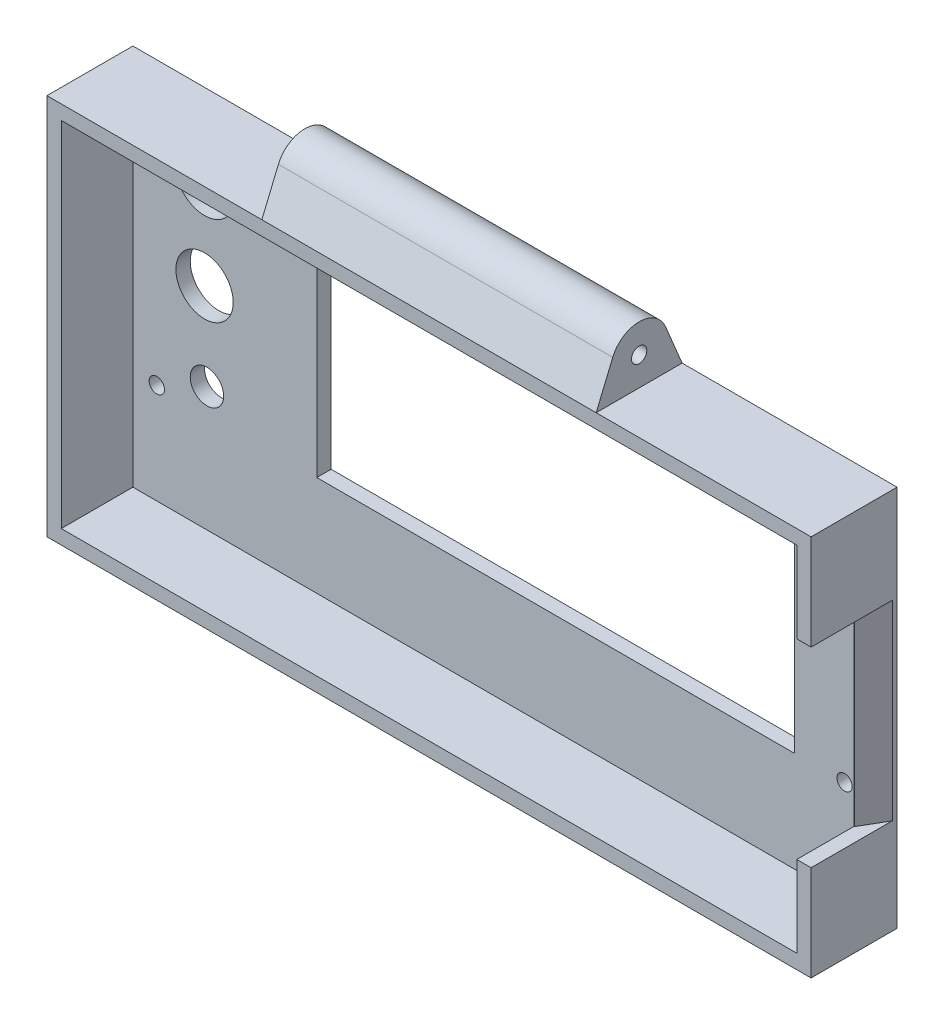
ISO-10303-21;
HEADER;
FILE_DESCRIPTION(('STEP AP214'),'2;1');
FILE_NAME('part.step','',(''),(''),'','','');
FILE_SCHEMA(('AUTOMOTIVE_DESIGN { 1 0 10303 214 1 1 1 1 }'));
ENDSEC;
DATA;
#1=APPLICATION_CONTEXT('core data for automotive mechanical design processes');
#2=APPLICATION_PROTOCOL_DEFINITION('international standard','automotive_design',2000,#1);
#3=PRODUCT_CONTEXT('',#1,'mechanical');
#4=PRODUCT('Part','Part','',(#3));
#5=PRODUCT_RELATED_PRODUCT_CATEGORY('part','',(#4));
#6=PRODUCT_DEFINITION_FORMATION('','',#4);
#7=PRODUCT_DEFINITION_CONTEXT('part definition',#1,'design');
#8=PRODUCT_DEFINITION('design','',#6,#7);
#9=PRODUCT_DEFINITION_SHAPE('','',#8);
#10=(LENGTH_UNIT() NAMED_UNIT(*) SI_UNIT(.MILLI.,.METRE.));
#11=(NAMED_UNIT(*) PLANE_ANGLE_UNIT() SI_UNIT($,.RADIAN.));
#12=(NAMED_UNIT(*) SI_UNIT($,.STERADIAN.) SOLID_ANGLE_UNIT());
#13=UNCERTAINTY_MEASURE_WITH_UNIT(LENGTH_MEASURE(1.E-05),#10,'distance_accuracy_value','');
#14=(GEOMETRIC_REPRESENTATION_CONTEXT(3) GLOBAL_UNCERTAINTY_ASSIGNED_CONTEXT((#13)) GLOBAL_UNIT_ASSIGNED_CONTEXT((#10,
#11,#12)) REPRESENTATION_CONTEXT('',''));
#15=CARTESIAN_POINT('',(0.,0.,0.));
#16=DIRECTION('',(0.,0.,1.));
#17=DIRECTION('',(1.,0.,0.));
#18=AXIS2_PLACEMENT_3D('',#15,#16,#17);
#19=CARTESIAN_POINT('',(80.,80.,0.));
#20=DIRECTION('',(0.,0.,-1.));
#21=DIRECTION('',(0.,1.,0.));
#22=AXIS2_PLACEMENT_3D('',#19,#20,#21);
#23=PLANE('',#22);
#24=DIRECTION('',(0.,-1.,0.));
#25=VECTOR('',#24,1.);
#26=CARTESIAN_POINT('',(77.,80.,0.));
#27=LINE('',#26,#25);
#28=CARTESIAN_POINT('',(77.,77.,0.));
#29=VERTEX_POINT('',#28);
#30=CARTESIAN_POINT('',(77.,60.,0.));
#31=VERTEX_POINT('',#30);
#32=EDGE_CURVE('E376',#29,#31,#27,.T.);
#33=ORIENTED_EDGE('',*,*,#32,.T.);
#34=DIRECTION('',(1.,0.,0.));
#35=VECTOR('',#34,1.);
#36=CARTESIAN_POINT('',(70.,60.,0.));
#37=LINE('',#36,#35);
#38=CARTESIAN_POINT('',(80.,60.,0.));
#39=VERTEX_POINT('',#38);
#40=EDGE_CURVE('E257',#31,#39,#37,.T.);
#41=ORIENTED_EDGE('',*,*,#40,.T.);
#42=DIRECTION('',(0.,-1.,0.));
#43=VECTOR('',#42,1.);
#44=CARTESIAN_POINT('',(80.,80.,0.));
#45=LINE('',#44,#43);
#46=CARTESIAN_POINT('',(80.,80.,0.));
#47=VERTEX_POINT('',#46);
#48=EDGE_CURVE('E193',#47,#39,#45,.T.);
#49=ORIENTED_EDGE('',*,*,#48,.F.);
#50=DIRECTION('',(-1.,0.,0.));
#51=VECTOR('',#50,1.);
#52=CARTESIAN_POINT('',(80.,80.,0.));
#53=LINE('',#52,#51);
#54=CARTESIAN_POINT('',(35.,80.,0.));
#55=VERTEX_POINT('',#54);
#56=EDGE_CURVE('E213',#47,#55,#53,.T.);
#57=ORIENTED_EDGE('',*,*,#56,.T.);
#58=CARTESIAN_POINT('',(-35.,80.,0.));
#59=VERTEX_POINT('',#58);
#60=EDGE_CURVE('E208',#55,#59,#53,.T.);
#61=ORIENTED_EDGE('',*,*,#60,.T.);
#62=DIRECTION('',(-1.,0.,0.));
#63=VECTOR('',#62,1.);
#64=CARTESIAN_POINT('',(-35.,80.,0.));
#65=LINE('',#64,#63);
#66=CARTESIAN_POINT('',(-80.,80.,0.));
#67=VERTEX_POINT('',#66);
#68=EDGE_CURVE('E261',#59,#67,#65,.T.);
#69=ORIENTED_EDGE('',*,*,#68,.T.);
#70=DIRECTION('',(0.,-1.,0.));
#71=VECTOR('',#70,1.);
#72=CARTESIAN_POINT('',(-80.,80.,0.));
#73=LINE('',#72,#71);
#74=CARTESIAN_POINT('',(-80.,0.,0.));
#75=VERTEX_POINT('',#74);
#76=EDGE_CURVE('E209',#67,#75,#73,.T.);
#77=ORIENTED_EDGE('',*,*,#76,.T.);
#78=DIRECTION('',(-1.,0.,0.));
#79=VECTOR('',#78,1.);
#80=CARTESIAN_POINT('',(80.,0.,0.));
#81=LINE('',#80,#79);
#82=CARTESIAN_POINT('',(80.,0.,0.));
#83=VERTEX_POINT('',#82);
#84=EDGE_CURVE('E192',#83,#75,#81,.T.);
#85=ORIENTED_EDGE('',*,*,#84,.F.);
#86=CARTESIAN_POINT('',(80.,20.,0.));
#87=VERTEX_POINT('',#86);
#88=EDGE_CURVE('E182',#87,#83,#45,.T.);
#89=ORIENTED_EDGE('',*,*,#88,.F.);
#90=DIRECTION('',(1.,0.,0.));
#91=VECTOR('',#90,1.);
#92=CARTESIAN_POINT('',(70.,20.,0.));
#93=LINE('',#92,#91);
#94=CARTESIAN_POINT('',(77.,20.,0.));
#95=VERTEX_POINT('',#94);
#96=EDGE_CURVE('E172',#95,#87,#93,.T.);
#97=ORIENTED_EDGE('',*,*,#96,.F.);
#98=CARTESIAN_POINT('',(77.,3.,0.));
#99=VERTEX_POINT('',#98);
#100=EDGE_CURVE('E385',#95,#99,#27,.T.);
#101=ORIENTED_EDGE('',*,*,#100,.T.);
#102=DIRECTION('',(-1.,0.,0.));
#103=VECTOR('',#102,1.);
#104=CARTESIAN_POINT('',(80.,3.,0.));
#105=LINE('',#104,#103);
#106=CARTESIAN_POINT('',(-77.,3.,0.));
#107=VERTEX_POINT('',#106);
#108=EDGE_CURVE('E211',#99,#107,#105,.T.);
#109=ORIENTED_EDGE('',*,*,#108,.T.);
#110=DIRECTION('',(0.,-1.,0.));
#111=VECTOR('',#110,1.);
#112=CARTESIAN_POINT('',(-77.,80.,0.));
#113=LINE('',#112,#111);
#114=CARTESIAN_POINT('',(-77.,77.,0.));
#115=VERTEX_POINT('',#114);
#116=EDGE_CURVE('E202',#115,#107,#113,.T.);
#117=ORIENTED_EDGE('',*,*,#116,.F.);
#118=DIRECTION('',(-1.,0.,0.));
#119=VECTOR('',#118,1.);
#120=CARTESIAN_POINT('',(80.,77.,0.));
#121=LINE('',#120,#119);
#122=EDGE_CURVE('E381',#29,#115,#121,.T.);
#123=ORIENTED_EDGE('',*,*,#122,.F.);
#124=EDGE_LOOP('',(#33,#41,#49,#57,#61,#69,#77,#85,#89,#97,#101,#109,#117,#123));
#125=FACE_BOUND('',#124,.T.);
#126=ADVANCED_FACE('F32',(#125),#23,.F.);
#127=CARTESIAN_POINT('',(80.,0.,0.));
#128=DIRECTION('',(0.,1.,0.));
#129=DIRECTION('',(0.,0.,1.));
#130=AXIS2_PLACEMENT_3D('',#127,#128,#129);
#131=PLANE('',#130);
#132=DIRECTION('',(0.,0.,-1.));
#133=VECTOR('',#132,1.);
#134=CARTESIAN_POINT('',(-80.,0.,0.));
#135=LINE('',#134,#133);
#136=CARTESIAN_POINT('',(-80.,0.,-18.));
#137=VERTEX_POINT('',#136);
#138=EDGE_CURVE('E198',#75,#137,#135,.T.);
#139=ORIENTED_EDGE('',*,*,#138,.T.);
#140=DIRECTION('',(-1.,0.,0.));
#141=VECTOR('',#140,1.);
#142=CARTESIAN_POINT('',(80.,0.,-18.));
#143=LINE('',#142,#141);
#144=CARTESIAN_POINT('',(80.,0.,-18.));
#145=VERTEX_POINT('',#144);
#146=EDGE_CURVE('E220',#145,#137,#143,.T.);
#147=ORIENTED_EDGE('',*,*,#146,.F.);
#148=DIRECTION('',(0.,0.,-1.));
#149=VECTOR('',#148,1.);
#150=CARTESIAN_POINT('',(80.,0.,0.));
#151=LINE('',#150,#149);
#152=EDGE_CURVE('E196',#83,#145,#151,.T.);
#153=ORIENTED_EDGE('',*,*,#152,.F.);
#154=ORIENTED_EDGE('',*,*,#84,.T.);
#155=EDGE_LOOP('',(#139,#147,#153,#154));
#156=FACE_BOUND('',#155,.T.);
#157=ADVANCED_FACE('F442',(#156),#131,.F.);
#158=CARTESIAN_POINT('',(80.,0.,-18.));
#159=DIRECTION('',(0.,0.,1.));
#160=DIRECTION('',(0.,-1.,0.));
#161=AXIS2_PLACEMENT_3D('',#158,#159,#160);
#162=PLANE('',#161);
#163=CARTESIAN_POINT('',(-72.,24.,-18.));
#164=DIRECTION('',(0.,0.,-1.));
#165=DIRECTION('',(-1.,0.,0.));
#166=AXIS2_PLACEMENT_3D('',#163,#164,#165);
#167=CIRCLE('',#166,1.6);
#168=CARTESIAN_POINT('',(-73.6,24.,-18.));
#169=VERTEX_POINT('',#168);
#170=EDGE_CURVE('E305',#169,#169,#167,.T.);
#171=ORIENTED_EDGE('',*,*,#170,.F.);
#172=EDGE_LOOP('',(#171));
#173=FACE_BOUND('',#172,.T.);
#174=CARTESIAN_POINT('',(-62.,47.,-18.));
#175=DIRECTION('',(0.,0.,-1.));
#176=DIRECTION('',(-1.,0.,0.));
#177=AXIS2_PLACEMENT_3D('',#174,#175,#176);
#178=CIRCLE('',#177,6.);
#179=CARTESIAN_POINT('',(-68.,47.,-18.));
#180=VERTEX_POINT('',#179);
#181=EDGE_CURVE('E300',#180,#180,#178,.T.);
#182=ORIENTED_EDGE('',*,*,#181,.F.);
#183=EDGE_LOOP('',(#182));
#184=FACE_BOUND('',#183,.T.);
#185=CARTESIAN_POINT('',(-61.5,29.,-18.));
#186=DIRECTION('',(0.,0.,-1.));
#187=DIRECTION('',(-1.,0.,0.));
#188=AXIS2_PLACEMENT_3D('',#185,#186,#187);
#189=CIRCLE('',#188,3.5);
#190=CARTESIAN_POINT('',(-65.,29.,-18.));
#191=VERTEX_POINT('',#190);
#192=EDGE_CURVE('E293',#191,#191,#189,.T.);
#193=ORIENTED_EDGE('',*,*,#192,.F.);
#194=EDGE_LOOP('',(#193));
#195=FACE_BOUND('',#194,.T.);
#196=CARTESIAN_POINT('',(-62.,66.,-18.));
#197=DIRECTION('',(0.,0.,-1.));
#198=DIRECTION('',(-1.,0.,0.));
#199=AXIS2_PLACEMENT_3D('',#196,#197,#198);
#200=CIRCLE('',#199,6.25000000000001);
#201=CARTESIAN_POINT('',(-68.25,66.,-18.));
#202=VERTEX_POINT('',#201);
#203=EDGE_CURVE('E291',#202,#202,#200,.T.);
#204=ORIENTED_EDGE('',*,*,#203,.F.);
#205=EDGE_LOOP('',(#204));
#206=FACE_BOUND('',#205,.T.);
#207=CARTESIAN_POINT('',(72.,24.,-18.));
#208=DIRECTION('',(0.,0.,-1.));
#209=DIRECTION('',(-1.,0.,0.));
#210=AXIS2_PLACEMENT_3D('',#207,#208,#209);
#211=CIRCLE('',#210,1.6);
#212=CARTESIAN_POINT('',(70.4,24.,-18.));
#213=VERTEX_POINT('',#212);
#214=EDGE_CURVE('E312',#213,#213,#211,.T.);
#215=ORIENTED_EDGE('',*,*,#214,.F.);
#216=EDGE_LOOP('',(#215));
#217=FACE_BOUND('',#216,.T.);
#218=CARTESIAN_POINT('',(72.,73.,-18.));
#219=DIRECTION('',(0.,0.,-1.));
#220=DIRECTION('',(-1.,0.,0.));
#221=AXIS2_PLACEMENT_3D('',#218,#219,#220);
#222=CIRCLE('',#221,1.60000000000001);
#223=CARTESIAN_POINT('',(70.4,73.,-18.));
#224=VERTEX_POINT('',#223);
#225=EDGE_CURVE('E325',#224,#224,#222,.T.);
#226=ORIENTED_EDGE('',*,*,#225,.F.);
#227=EDGE_LOOP('',(#226));
#228=FACE_BOUND('',#227,.T.);
#229=CARTESIAN_POINT('',(-72.,73.,-18.));
#230=DIRECTION('',(0.,0.,-1.));
#231=DIRECTION('',(-1.,0.,0.));
#232=AXIS2_PLACEMENT_3D('',#229,#230,#231);
#233=CIRCLE('',#232,1.60000000000001);
#234=CARTESIAN_POINT('',(-73.6,73.,-18.));
#235=VERTEX_POINT('',#234);
#236=EDGE_CURVE('E317',#235,#235,#233,.T.);
#237=ORIENTED_EDGE('',*,*,#236,.F.);
#238=EDGE_LOOP('',(#237));
#239=FACE_BOUND('',#238,.T.);
#240=DIRECTION('',(0.,-1.,0.));
#241=VECTOR('',#240,1.);
#242=CARTESIAN_POINT('',(61.5,64.,-18.));
#243=LINE('',#242,#241);
#244=CARTESIAN_POINT('',(61.5,64.,-18.));
#245=VERTEX_POINT('',#244);
#246=CARTESIAN_POINT('',(61.5,24.,-18.));
#247=VERTEX_POINT('',#246);
#248=EDGE_CURVE('E338',#245,#247,#243,.T.);
#249=ORIENTED_EDGE('',*,*,#248,.F.);
#250=DIRECTION('',(1.,0.,0.));
#251=VECTOR('',#250,1.);
#252=CARTESIAN_POINT('',(61.5,64.,-18.));
#253=LINE('',#252,#251);
#254=CARTESIAN_POINT('',(-38.5,64.,-18.));
#255=VERTEX_POINT('',#254);
#256=EDGE_CURVE('E341',#255,#245,#253,.T.);
#257=ORIENTED_EDGE('',*,*,#256,.F.);
#258=DIRECTION('',(0.,1.,0.));
#259=VECTOR('',#258,1.);
#260=CARTESIAN_POINT('',(-38.5,64.,-18.));
#261=LINE('',#260,#259);
#262=CARTESIAN_POINT('',(-38.5,24.,-18.));
#263=VERTEX_POINT('',#262);
#264=EDGE_CURVE('E324',#263,#255,#261,.T.);
#265=ORIENTED_EDGE('',*,*,#264,.F.);
#266=DIRECTION('',(-1.,0.,0.));
#267=VECTOR('',#266,1.);
#268=CARTESIAN_POINT('',(61.5,24.,-18.));
#269=LINE('',#268,#267);
#270=EDGE_CURVE('E335',#247,#263,#269,.T.);
#271=ORIENTED_EDGE('',*,*,#270,.F.);
#272=EDGE_LOOP('',(#249,#257,#265,#271));
#273=FACE_BOUND('',#272,.T.);
#274=DIRECTION('',(0.,1.,0.));
#275=VECTOR('',#274,1.);
#276=CARTESIAN_POINT('',(-80.,0.,-18.));
#277=LINE('',#276,#275);
#278=CARTESIAN_POINT('',(-80.,80.,-18.));
#279=VERTEX_POINT('',#278);
#280=EDGE_CURVE('E194',#137,#279,#277,.T.);
#281=ORIENTED_EDGE('',*,*,#280,.T.);
#282=DIRECTION('',(-1.,0.,0.));
#283=VECTOR('',#282,1.);
#284=CARTESIAN_POINT('',(-35.,80.,-18.));
#285=LINE('',#284,#283);
#286=CARTESIAN_POINT('',(-35.,80.,-18.));
#287=VERTEX_POINT('',#286);
#288=EDGE_CURVE('E265',#287,#279,#285,.T.);
#289=ORIENTED_EDGE('',*,*,#288,.F.);
#290=DIRECTION('',(-1.,0.,0.));
#291=VECTOR('',#290,1.);
#292=CARTESIAN_POINT('',(80.,80.,-18.));
#293=LINE('',#292,#291);
#294=CARTESIAN_POINT('',(35.,80.,-18.));
#295=VERTEX_POINT('',#294);
#296=EDGE_CURVE('E216',#295,#287,#293,.T.);
#297=ORIENTED_EDGE('',*,*,#296,.F.);
#298=CARTESIAN_POINT('',(80.,80.,-18.));
#299=VERTEX_POINT('',#298);
#300=EDGE_CURVE('E217',#299,#295,#293,.T.);
#301=ORIENTED_EDGE('',*,*,#300,.F.);
#302=DIRECTION('',(0.,1.,0.));
#303=VECTOR('',#302,1.);
#304=CARTESIAN_POINT('',(80.,0.,-18.));
#305=LINE('',#304,#303);
#306=EDGE_CURVE('E205',#145,#299,#305,.T.);
#307=ORIENTED_EDGE('',*,*,#306,.F.);
#308=ORIENTED_EDGE('',*,*,#146,.T.);
#309=EDGE_LOOP('',(#281,#289,#297,#301,#307,#308));
#310=FACE_BOUND('',#309,.T.);
#311=ADVANCED_FACE('F437',(#173,#184,#195,#206,#217,#228,#239,#273,#310),#162,.F.);
#312=CARTESIAN_POINT('',(80.,0.,0.));
#313=DIRECTION('',(1.,0.,0.));
#314=DIRECTION('',(0.,0.,-1.));
#315=AXIS2_PLACEMENT_3D('',#312,#313,#314);
#316=PLANE('',#315);
#317=DIRECTION('',(0.,0.,1.));
#318=VECTOR('',#317,1.);
#319=CARTESIAN_POINT('',(80.,60.,0.));
#320=LINE('',#319,#318);
#321=CARTESIAN_POINT('',(80.,60.,-17.));
#322=VERTEX_POINT('',#321);
#323=EDGE_CURVE('E47',#322,#39,#320,.T.);
#324=ORIENTED_EDGE('',*,*,#323,.F.);
#325=DIRECTION('',(0.,-1.,0.));
#326=VECTOR('',#325,1.);
#327=CARTESIAN_POINT('',(80.,20.,-17.));
#328=LINE('',#327,#326);
#329=CARTESIAN_POINT('',(80.,20.,-17.));
#330=VERTEX_POINT('',#329);
#331=EDGE_CURVE('E185',#322,#330,#328,.T.);
#332=ORIENTED_EDGE('',*,*,#331,.T.);
#333=DIRECTION('',(0.,0.,-1.));
#334=VECTOR('',#333,1.);
#335=CARTESIAN_POINT('',(80.,20.,0.));
#336=LINE('',#335,#334);
#337=EDGE_CURVE('E54',#87,#330,#336,.T.);
#338=ORIENTED_EDGE('',*,*,#337,.F.);
#339=ORIENTED_EDGE('',*,*,#88,.T.);
#340=ORIENTED_EDGE('',*,*,#152,.T.);
#341=ORIENTED_EDGE('',*,*,#306,.T.);
#342=DIRECTION('',(0.,0.,-1.));
#343=VECTOR('',#342,1.);
#344=CARTESIAN_POINT('',(80.,80.,0.));
#345=LINE('',#344,#343);
#346=EDGE_CURVE('E228',#47,#299,#345,.T.);
#347=ORIENTED_EDGE('',*,*,#346,.F.);
#348=ORIENTED_EDGE('',*,*,#48,.T.);
#349=EDGE_LOOP('',(#324,#332,#338,#339,#340,#341,#347,#348));
#350=FACE_BOUND('',#349,.T.);
#351=ADVANCED_FACE('F181',(#350),#316,.T.);
#352=CARTESIAN_POINT('',(-80.,0.,0.));
#353=DIRECTION('',(1.,0.,0.));
#354=DIRECTION('',(0.,0.,-1.));
#355=AXIS2_PLACEMENT_3D('',#352,#353,#354);
#356=PLANE('',#355);
#357=ORIENTED_EDGE('',*,*,#76,.F.);
#358=DIRECTION('',(0.,0.,-1.));
#359=VECTOR('',#358,1.);
#360=CARTESIAN_POINT('',(-80.,80.,0.));
#361=LINE('',#360,#359);
#362=EDGE_CURVE('E233',#67,#279,#361,.T.);
#363=ORIENTED_EDGE('',*,*,#362,.T.);
#364=ORIENTED_EDGE('',*,*,#280,.F.);
#365=ORIENTED_EDGE('',*,*,#138,.F.);
#366=EDGE_LOOP('',(#357,#363,#364,#365));
#367=FACE_BOUND('',#366,.T.);
#368=ADVANCED_FACE('F435',(#367),#356,.F.);
#369=CARTESIAN_POINT('',(80.,3.,0.));
#370=DIRECTION('',(0.,1.,0.));
#371=DIRECTION('',(0.,0.,1.));
#372=AXIS2_PLACEMENT_3D('',#369,#370,#371);
#373=PLANE('',#372);
#374=DIRECTION('',(0.,0.,-1.));
#375=VECTOR('',#374,1.);
#376=CARTESIAN_POINT('',(-77.,3.,0.));
#377=LINE('',#376,#375);
#378=CARTESIAN_POINT('',(-77.,3.00000000000001,-15.));
#379=VERTEX_POINT('',#378);
#380=EDGE_CURVE('E366',#107,#379,#377,.T.);
#381=ORIENTED_EDGE('',*,*,#380,.F.);
#382=ORIENTED_EDGE('',*,*,#108,.F.);
#383=DIRECTION('',(0.,0.,-1.));
#384=VECTOR('',#383,1.);
#385=CARTESIAN_POINT('',(77.,3.,0.));
#386=LINE('',#385,#384);
#387=CARTESIAN_POINT('',(77.,3.00000000000001,-15.));
#388=VERTEX_POINT('',#387);
#389=EDGE_CURVE('E373',#99,#388,#386,.T.);
#390=ORIENTED_EDGE('',*,*,#389,.T.);
#391=DIRECTION('',(-1.,0.,0.));
#392=VECTOR('',#391,1.);
#393=CARTESIAN_POINT('',(80.,3.00000000000001,-15.));
#394=LINE('',#393,#392);
#395=EDGE_CURVE('E369',#388,#379,#394,.T.);
#396=ORIENTED_EDGE('',*,*,#395,.T.);
#397=EDGE_LOOP('',(#381,#382,#390,#396));
#398=FACE_BOUND('',#397,.T.);
#399=ADVANCED_FACE('F454',(#398),#373,.T.);
#400=CARTESIAN_POINT('',(80.,0.,-15.));
#401=DIRECTION('',(0.,0.,1.));
#402=DIRECTION('',(0.,-1.,0.));
#403=AXIS2_PLACEMENT_3D('',#400,#401,#402);
#404=PLANE('',#403);
#405=CARTESIAN_POINT('',(-72.,24.,-15.));
#406=DIRECTION('',(0.,0.,1.));
#407=DIRECTION('',(0.,-1.,0.));
#408=AXIS2_PLACEMENT_3D('',#405,#406,#407);
#409=CIRCLE('',#408,1.6);
#410=CARTESIAN_POINT('',(-72.,22.4,-15.));
#411=VERTEX_POINT('',#410);
#412=EDGE_CURVE('E308',#411,#411,#409,.F.);
#413=ORIENTED_EDGE('',*,*,#412,.T.);
#414=EDGE_LOOP('',(#413));
#415=FACE_BOUND('',#414,.T.);
#416=CARTESIAN_POINT('',(-62.,47.,-15.));
#417=DIRECTION('',(0.,0.,1.));
#418=DIRECTION('',(0.,-1.,0.));
#419=AXIS2_PLACEMENT_3D('',#416,#417,#418);
#420=CIRCLE('',#419,6.);
#421=CARTESIAN_POINT('',(-62.,41.,-15.));
#422=VERTEX_POINT('',#421);
#423=EDGE_CURVE('E309',#422,#422,#420,.F.);
#424=ORIENTED_EDGE('',*,*,#423,.T.);
#425=EDGE_LOOP('',(#424));
#426=FACE_BOUND('',#425,.T.);
#427=CARTESIAN_POINT('',(-61.5,29.,-15.));
#428=DIRECTION('',(0.,0.,1.));
#429=DIRECTION('',(0.,-1.,0.));
#430=AXIS2_PLACEMENT_3D('',#427,#428,#429);
#431=CIRCLE('',#430,3.5);
#432=CARTESIAN_POINT('',(-61.5,25.5,-15.));
#433=VERTEX_POINT('',#432);
#434=EDGE_CURVE('E296',#433,#433,#431,.F.);
#435=ORIENTED_EDGE('',*,*,#434,.T.);
#436=EDGE_LOOP('',(#435));
#437=FACE_BOUND('',#436,.T.);
#438=CARTESIAN_POINT('',(-62.,66.,-15.));
#439=DIRECTION('',(0.,0.,1.));
#440=DIRECTION('',(0.,-1.,0.));
#441=AXIS2_PLACEMENT_3D('',#438,#439,#440);
#442=CIRCLE('',#441,6.25000000000001);
#443=CARTESIAN_POINT('',(-62.,59.75,-15.));
#444=VERTEX_POINT('',#443);
#445=EDGE_CURVE('E297',#444,#444,#442,.F.);
#446=ORIENTED_EDGE('',*,*,#445,.T.);
#447=EDGE_LOOP('',(#446));
#448=FACE_BOUND('',#447,.T.);
#449=CARTESIAN_POINT('',(72.,24.,-15.));
#450=DIRECTION('',(0.,0.,1.));
#451=DIRECTION('',(0.,-1.,0.));
#452=AXIS2_PLACEMENT_3D('',#449,#450,#451);
#453=CIRCLE('',#452,1.6);
#454=CARTESIAN_POINT('',(72.,22.4,-15.));
#455=VERTEX_POINT('',#454);
#456=EDGE_CURVE('E328',#455,#455,#453,.F.);
#457=ORIENTED_EDGE('',*,*,#456,.T.);
#458=EDGE_LOOP('',(#457));
#459=FACE_BOUND('',#458,.T.);
#460=CARTESIAN_POINT('',(72.,73.,-15.));
#461=DIRECTION('',(0.,0.,1.));
#462=DIRECTION('',(0.,-1.,0.));
#463=AXIS2_PLACEMENT_3D('',#460,#461,#462);
#464=CIRCLE('',#463,1.60000000000001);
#465=CARTESIAN_POINT('',(72.,71.4,-15.));
#466=VERTEX_POINT('',#465);
#467=EDGE_CURVE('E321',#466,#466,#464,.F.);
#468=ORIENTED_EDGE('',*,*,#467,.T.);
#469=EDGE_LOOP('',(#468));
#470=FACE_BOUND('',#469,.T.);
#471=CARTESIAN_POINT('',(-72.,73.,-15.));
#472=DIRECTION('',(0.,0.,1.));
#473=DIRECTION('',(0.,-1.,0.));
#474=AXIS2_PLACEMENT_3D('',#471,#472,#473);
#475=CIRCLE('',#474,1.60000000000001);
#476=CARTESIAN_POINT('',(-72.,71.4,-15.));
#477=VERTEX_POINT('',#476);
#478=EDGE_CURVE('E320',#477,#477,#475,.F.);
#479=ORIENTED_EDGE('',*,*,#478,.T.);
#480=EDGE_LOOP('',(#479));
#481=FACE_BOUND('',#480,.T.);
#482=DIRECTION('',(1.,0.,0.));
#483=VECTOR('',#482,1.);
#484=CARTESIAN_POINT('',(61.5,64.,-15.));
#485=LINE('',#484,#483);
#486=CARTESIAN_POINT('',(-38.5,64.,-15.));
#487=VERTEX_POINT('',#486);
#488=CARTESIAN_POINT('',(61.5,64.,-15.));
#489=VERTEX_POINT('',#488);
#490=EDGE_CURVE('E337',#487,#489,#485,.T.);
#491=ORIENTED_EDGE('',*,*,#490,.T.);
#492=DIRECTION('',(0.,-1.,0.));
#493=VECTOR('',#492,1.);
#494=CARTESIAN_POINT('',(61.5,64.,-15.));
#495=LINE('',#494,#493);
#496=CARTESIAN_POINT('',(61.5,24.,-15.));
#497=VERTEX_POINT('',#496);
#498=EDGE_CURVE('E358',#489,#497,#495,.T.);
#499=ORIENTED_EDGE('',*,*,#498,.T.);
#500=DIRECTION('',(-1.,0.,0.));
#501=VECTOR('',#500,1.);
#502=CARTESIAN_POINT('',(61.5,24.,-15.));
#503=LINE('',#502,#501);
#504=CARTESIAN_POINT('',(-38.5,24.,-15.));
#505=VERTEX_POINT('',#504);
#506=EDGE_CURVE('E354',#497,#505,#503,.T.);
#507=ORIENTED_EDGE('',*,*,#506,.T.);
#508=DIRECTION('',(0.,1.,0.));
#509=VECTOR('',#508,1.);
#510=CARTESIAN_POINT('',(-38.5,64.,-15.));
#511=LINE('',#510,#509);
#512=EDGE_CURVE('E349',#505,#487,#511,.T.);
#513=ORIENTED_EDGE('',*,*,#512,.T.);
#514=EDGE_LOOP('',(#491,#499,#507,#513));
#515=FACE_BOUND('',#514,.T.);
#516=DIRECTION('',(0.,1.,0.));
#517=VECTOR('',#516,1.);
#518=CARTESIAN_POINT('',(-77.,0.,-15.));
#519=LINE('',#518,#517);
#520=CARTESIAN_POINT('',(-77.,77.,-15.));
#521=VERTEX_POINT('',#520);
#522=EDGE_CURVE('E368',#379,#521,#519,.T.);
#523=ORIENTED_EDGE('',*,*,#522,.F.);
#524=ORIENTED_EDGE('',*,*,#395,.F.);
#525=DIRECTION('',(0.,1.,0.));
#526=VECTOR('',#525,1.);
#527=CARTESIAN_POINT('',(77.,0.,-15.));
#528=LINE('',#527,#526);
#529=CARTESIAN_POINT('',(77.,77.,-15.));
#530=VERTEX_POINT('',#529);
#531=EDGE_CURVE('E375',#388,#530,#528,.T.);
#532=ORIENTED_EDGE('',*,*,#531,.T.);
#533=DIRECTION('',(-1.,0.,0.));
#534=VECTOR('',#533,1.);
#535=CARTESIAN_POINT('',(80.,77.,-15.));
#536=LINE('',#535,#534);
#537=EDGE_CURVE('E372',#530,#521,#536,.T.);
#538=ORIENTED_EDGE('',*,*,#537,.T.);
#539=EDGE_LOOP('',(#523,#524,#532,#538));
#540=FACE_BOUND('',#539,.T.);
#541=ADVANCED_FACE('F405',(#415,#426,#437,#448,#459,#470,#481,#515,#540),#404,.T.);
#542=CARTESIAN_POINT('',(80.,77.,-18.));
#543=DIRECTION('',(0.,-1.,0.));
#544=DIRECTION('',(0.,0.,-1.));
#545=AXIS2_PLACEMENT_3D('',#542,#543,#544);
#546=PLANE('',#545);
#547=DIRECTION('',(0.,0.,1.));
#548=VECTOR('',#547,1.);
#549=CARTESIAN_POINT('',(-77.,77.,-18.));
#550=LINE('',#549,#548);
#551=EDGE_CURVE('E378',#521,#115,#550,.T.);
#552=ORIENTED_EDGE('',*,*,#551,.F.);
#553=ORIENTED_EDGE('',*,*,#537,.F.);
#554=DIRECTION('',(0.,0.,1.));
#555=VECTOR('',#554,1.);
#556=CARTESIAN_POINT('',(77.,77.,-18.));
#557=LINE('',#556,#555);
#558=EDGE_CURVE('E383',#530,#29,#557,.T.);
#559=ORIENTED_EDGE('',*,*,#558,.T.);
#560=ORIENTED_EDGE('',*,*,#122,.T.);
#561=EDGE_LOOP('',(#552,#553,#559,#560));
#562=FACE_BOUND('',#561,.T.);
#563=ADVANCED_FACE('F395',(#562),#546,.T.);
#564=CARTESIAN_POINT('',(77.,0.,0.));
#565=DIRECTION('',(1.,0.,0.));
#566=DIRECTION('',(0.,0.,-1.));
#567=AXIS2_PLACEMENT_3D('',#564,#565,#566);
#568=PLANE('',#567);
#569=DIRECTION('',(0.,1.,0.));
#570=VECTOR('',#569,1.);
#571=CARTESIAN_POINT('',(77.,0.,-12.));
#572=LINE('',#571,#570);
#573=CARTESIAN_POINT('',(77.,20.,-12.));
#574=VERTEX_POINT('',#573);
#575=CARTESIAN_POINT('',(77.,60.,-12.));
#576=VERTEX_POINT('',#575);
#577=EDGE_CURVE('E235',#574,#576,#572,.T.);
#578=ORIENTED_EDGE('',*,*,#577,.T.);
#579=DIRECTION('',(0.,0.,1.));
#580=VECTOR('',#579,1.);
#581=CARTESIAN_POINT('',(77.,60.,0.));
#582=LINE('',#581,#580);
#583=EDGE_CURVE('E238',#576,#31,#582,.T.);
#584=ORIENTED_EDGE('',*,*,#583,.T.);
#585=ORIENTED_EDGE('',*,*,#32,.F.);
#586=ORIENTED_EDGE('',*,*,#558,.F.);
#587=ORIENTED_EDGE('',*,*,#531,.F.);
#588=ORIENTED_EDGE('',*,*,#389,.F.);
#589=ORIENTED_EDGE('',*,*,#100,.F.);
#590=DIRECTION('',(0.,0.,-1.));
#591=VECTOR('',#590,1.);
#592=CARTESIAN_POINT('',(77.,20.,0.));
#593=LINE('',#592,#591);
#594=EDGE_CURVE('E175',#95,#574,#593,.T.);
#595=ORIENTED_EDGE('',*,*,#594,.T.);
#596=EDGE_LOOP('',(#578,#584,#585,#586,#587,#588,#589,#595));
#597=FACE_BOUND('',#596,.T.);
#598=ADVANCED_FACE('F408',(#597),#568,.F.);
#599=CARTESIAN_POINT('',(-77.,0.,0.));
#600=DIRECTION('',(1.,0.,0.));
#601=DIRECTION('',(0.,0.,-1.));
#602=AXIS2_PLACEMENT_3D('',#599,#600,#601);
#603=PLANE('',#602);
#604=ORIENTED_EDGE('',*,*,#116,.T.);
#605=ORIENTED_EDGE('',*,*,#380,.T.);
#606=ORIENTED_EDGE('',*,*,#522,.T.);
#607=ORIENTED_EDGE('',*,*,#551,.T.);
#608=EDGE_LOOP('',(#604,#605,#606,#607));
#609=FACE_BOUND('',#608,.T.);
#610=ADVANCED_FACE('F401',(#609),#603,.T.);
#611=CARTESIAN_POINT('',(61.5,64.,92.7032961426901));
#612=DIRECTION('',(0.,1.,0.));
#613=DIRECTION('',(-1.,0.,0.));
#614=AXIS2_PLACEMENT_3D('',#611,#612,#613);
#615=PLANE('',#614);
#616=DIRECTION('',(0.,0.,-1.));
#617=VECTOR('',#616,1.);
#618=CARTESIAN_POINT('',(-38.5,64.,92.7032961426901));
#619=LINE('',#618,#617);
#620=EDGE_CURVE('E352',#487,#255,#619,.T.);
#621=ORIENTED_EDGE('',*,*,#620,.T.);
#622=ORIENTED_EDGE('',*,*,#256,.T.);
#623=DIRECTION('',(0.,0.,-1.));
#624=VECTOR('',#623,1.);
#625=CARTESIAN_POINT('',(61.5,64.,92.7032961426901));
#626=LINE('',#625,#624);
#627=EDGE_CURVE('E348',#489,#245,#626,.T.);
#628=ORIENTED_EDGE('',*,*,#627,.F.);
#629=ORIENTED_EDGE('',*,*,#490,.F.);
#630=EDGE_LOOP('',(#621,#622,#628,#629));
#631=FACE_BOUND('',#630,.T.);
#632=ADVANCED_FACE('F459',(#631),#615,.F.);
#633=CARTESIAN_POINT('',(61.5,64.,92.7032961426901));
#634=DIRECTION('',(1.,0.,0.));
#635=DIRECTION('',(0.,0.,-1.));
#636=AXIS2_PLACEMENT_3D('',#633,#634,#635);
#637=PLANE('',#636);
#638=ORIENTED_EDGE('',*,*,#627,.T.);
#639=ORIENTED_EDGE('',*,*,#248,.T.);
#640=DIRECTION('',(0.,0.,-1.));
#641=VECTOR('',#640,1.);
#642=CARTESIAN_POINT('',(61.5,24.,92.7032961426901));
#643=LINE('',#642,#641);
#644=EDGE_CURVE('E357',#497,#247,#643,.T.);
#645=ORIENTED_EDGE('',*,*,#644,.F.);
#646=ORIENTED_EDGE('',*,*,#498,.F.);
#647=EDGE_LOOP('',(#638,#639,#645,#646));
#648=FACE_BOUND('',#647,.T.);
#649=ADVANCED_FACE('F472',(#648),#637,.F.);
#650=CARTESIAN_POINT('',(61.5,24.,92.7032961426901));
#651=DIRECTION('',(0.,-1.,0.));
#652=DIRECTION('',(1.,0.,0.));
#653=AXIS2_PLACEMENT_3D('',#650,#651,#652);
#654=PLANE('',#653);
#655=ORIENTED_EDGE('',*,*,#644,.T.);
#656=ORIENTED_EDGE('',*,*,#270,.T.);
#657=DIRECTION('',(0.,0.,-1.));
#658=VECTOR('',#657,1.);
#659=CARTESIAN_POINT('',(-38.5,24.,92.7032961426901));
#660=LINE('',#659,#658);
#661=EDGE_CURVE('E353',#505,#263,#660,.T.);
#662=ORIENTED_EDGE('',*,*,#661,.F.);
#663=ORIENTED_EDGE('',*,*,#506,.F.);
#664=EDGE_LOOP('',(#655,#656,#662,#663));
#665=FACE_BOUND('',#664,.T.);
#666=ADVANCED_FACE('F476',(#665),#654,.F.);
#667=CARTESIAN_POINT('',(-38.5,64.,92.7032961426901));
#668=DIRECTION('',(-1.,0.,0.));
#669=DIRECTION('',(0.,0.,1.));
#670=AXIS2_PLACEMENT_3D('',#667,#668,#669);
#671=PLANE('',#670);
#672=ORIENTED_EDGE('',*,*,#661,.T.);
#673=ORIENTED_EDGE('',*,*,#264,.T.);
#674=ORIENTED_EDGE('',*,*,#620,.F.);
#675=ORIENTED_EDGE('',*,*,#512,.F.);
#676=EDGE_LOOP('',(#672,#673,#674,#675));
#677=FACE_BOUND('',#676,.T.);
#678=ADVANCED_FACE('F480',(#677),#671,.F.);
#679=CARTESIAN_POINT('',(-72.,73.,92.7032961426901));
#680=DIRECTION('',(0.,0.,-1.));
#681=DIRECTION('',(-1.,0.,0.));
#682=AXIS2_PLACEMENT_3D('',#679,#680,#681);
#683=CYLINDRICAL_SURFACE('',#682,1.60000000000001);
#684=ORIENTED_EDGE('',*,*,#236,.T.);
#685=EDGE_LOOP('',(#684));
#686=FACE_BOUND('',#685,.T.);
#687=ORIENTED_EDGE('',*,*,#478,.F.);
#688=EDGE_LOOP('',(#687));
#689=FACE_BOUND('',#688,.T.);
#690=ADVANCED_FACE('F484',(#686,#689),#683,.F.);
#691=CARTESIAN_POINT('',(72.,73.,92.7032961426901));
#692=DIRECTION('',(0.,0.,-1.));
#693=DIRECTION('',(-1.,0.,0.));
#694=AXIS2_PLACEMENT_3D('',#691,#692,#693);
#695=CYLINDRICAL_SURFACE('',#694,1.60000000000001);
#696=ORIENTED_EDGE('',*,*,#225,.T.);
#697=EDGE_LOOP('',(#696));
#698=FACE_BOUND('',#697,.T.);
#699=ORIENTED_EDGE('',*,*,#467,.F.);
#700=EDGE_LOOP('',(#699));
#701=FACE_BOUND('',#700,.T.);
#702=ADVANCED_FACE('F490',(#698,#701),#695,.F.);
#703=CARTESIAN_POINT('',(72.,24.,92.7032961426901));
#704=DIRECTION('',(0.,0.,-1.));
#705=DIRECTION('',(-1.,0.,0.));
#706=AXIS2_PLACEMENT_3D('',#703,#704,#705);
#707=CYLINDRICAL_SURFACE('',#706,1.6);
#708=ORIENTED_EDGE('',*,*,#214,.T.);
#709=EDGE_LOOP('',(#708));
#710=FACE_BOUND('',#709,.T.);
#711=ORIENTED_EDGE('',*,*,#456,.F.);
#712=EDGE_LOOP('',(#711));
#713=FACE_BOUND('',#712,.T.);
#714=ADVANCED_FACE('F486',(#710,#713),#707,.F.);
#715=CARTESIAN_POINT('',(-62.,66.,92.7032961426901));
#716=DIRECTION('',(0.,0.,-1.));
#717=DIRECTION('',(-1.,0.,0.));
#718=AXIS2_PLACEMENT_3D('',#715,#716,#717);
#719=CYLINDRICAL_SURFACE('',#718,6.25000000000001);
#720=ORIENTED_EDGE('',*,*,#203,.T.);
#721=EDGE_LOOP('',(#720));
#722=FACE_BOUND('',#721,.T.);
#723=ORIENTED_EDGE('',*,*,#445,.F.);
#724=EDGE_LOOP('',(#723));
#725=FACE_BOUND('',#724,.T.);
#726=ADVANCED_FACE('F489',(#722,#725),#719,.F.);
#727=CARTESIAN_POINT('',(-61.5,29.,92.7032961426901));
#728=DIRECTION('',(0.,0.,-1.));
#729=DIRECTION('',(-1.,0.,0.));
#730=AXIS2_PLACEMENT_3D('',#727,#728,#729);
#731=CYLINDRICAL_SURFACE('',#730,3.5);
#732=ORIENTED_EDGE('',*,*,#192,.T.);
#733=EDGE_LOOP('',(#732));
#734=FACE_BOUND('',#733,.T.);
#735=ORIENTED_EDGE('',*,*,#434,.F.);
#736=EDGE_LOOP('',(#735));
#737=FACE_BOUND('',#736,.T.);
#738=ADVANCED_FACE('F502',(#734,#737),#731,.F.);
#739=CARTESIAN_POINT('',(-62.,47.,92.7032961426901));
#740=DIRECTION('',(0.,0.,-1.));
#741=DIRECTION('',(-1.,0.,0.));
#742=AXIS2_PLACEMENT_3D('',#739,#740,#741);
#743=CYLINDRICAL_SURFACE('',#742,6.);
#744=ORIENTED_EDGE('',*,*,#181,.T.);
#745=EDGE_LOOP('',(#744));
#746=FACE_BOUND('',#745,.T.);
#747=ORIENTED_EDGE('',*,*,#423,.F.);
#748=EDGE_LOOP('',(#747));
#749=FACE_BOUND('',#748,.T.);
#750=ADVANCED_FACE('F498',(#746,#749),#743,.F.);
#751=CARTESIAN_POINT('',(-72.,24.,92.7032961426901));
#752=DIRECTION('',(0.,0.,-1.));
#753=DIRECTION('',(-1.,0.,0.));
#754=AXIS2_PLACEMENT_3D('',#751,#752,#753);
#755=CYLINDRICAL_SURFACE('',#754,1.6);
#756=ORIENTED_EDGE('',*,*,#170,.T.);
#757=EDGE_LOOP('',(#756));
#758=FACE_BOUND('',#757,.T.);
#759=ORIENTED_EDGE('',*,*,#412,.F.);
#760=EDGE_LOOP('',(#759));
#761=FACE_BOUND('',#760,.T.);
#762=ADVANCED_FACE('F501',(#758,#761),#755,.F.);
#763=CARTESIAN_POINT('',(-80.,86.,-9.00000000000001));
#764=DIRECTION('',(1.,0.,0.));
#765=DIRECTION('',(0.,0.,-1.));
#766=AXIS2_PLACEMENT_3D('',#763,#764,#765);
#767=CYLINDRICAL_SURFACE('',#766,5.99999999999999);
#768=CARTESIAN_POINT('',(-35.,86.,-9.00000000000001));
#769=DIRECTION('',(1.,0.,0.));
#770=DIRECTION('',(0.,0.,-1.));
#771=AXIS2_PLACEMENT_3D('',#768,#769,#770);
#772=CIRCLE('',#771,5.99999999999999);
#773=CARTESIAN_POINT('',(-35.,88.3076923076923,-3.46153846153848));
#774=VERTEX_POINT('',#773);
#775=CARTESIAN_POINT('',(-35.,88.3076923076923,-14.5384615384615));
#776=VERTEX_POINT('',#775);
#777=EDGE_CURVE('E273',#774,#776,#772,.F.);
#778=ORIENTED_EDGE('',*,*,#777,.F.);
#779=DIRECTION('',(1.,0.,0.));
#780=VECTOR('',#779,1.);
#781=CARTESIAN_POINT('',(-80.,88.3076923076923,-3.46153846153848));
#782=LINE('',#781,#780);
#783=CARTESIAN_POINT('',(35.,88.3076923076923,-3.46153846153848));
#784=VERTEX_POINT('',#783);
#785=EDGE_CURVE('E288',#774,#784,#782,.T.);
#786=ORIENTED_EDGE('',*,*,#785,.T.);
#787=CARTESIAN_POINT('',(35.,86.,-9.00000000000001));
#788=DIRECTION('',(-1.,0.,0.));
#789=DIRECTION('',(0.,0.,1.));
#790=AXIS2_PLACEMENT_3D('',#787,#788,#789);
#791=CIRCLE('',#790,5.99999999999999);
#792=CARTESIAN_POINT('',(35.,88.3076923076923,-14.5384615384615));
#793=VERTEX_POINT('',#792);
#794=EDGE_CURVE('E282',#793,#784,#791,.F.);
#795=ORIENTED_EDGE('',*,*,#794,.F.);
#796=DIRECTION('',(1.,0.,0.));
#797=VECTOR('',#796,1.);
#798=CARTESIAN_POINT('',(-80.,88.3076923076923,-14.5384615384615));
#799=LINE('',#798,#797);
#800=EDGE_CURVE('E289',#776,#793,#799,.T.);
#801=ORIENTED_EDGE('',*,*,#800,.F.);
#802=EDGE_LOOP('',(#778,#786,#795,#801));
#803=FACE_BOUND('',#802,.T.);
#804=ADVANCED_FACE('F506',(#803),#767,.T.);
#805=CARTESIAN_POINT('',(-80.,88.3076923076923,-14.5384615384615));
#806=DIRECTION('',(0.,0.384615384615386,-0.923076923076922));
#807=DIRECTION('',(0.,0.923076923076922,0.384615384615386));
#808=AXIS2_PLACEMENT_3D('',#805,#806,#807);
#809=PLANE('',#808);
#810=DIRECTION('',(0.,-0.923076923076922,-0.384615384615386));
#811=VECTOR('',#810,1.);
#812=CARTESIAN_POINT('',(-35.,88.3076923076923,-14.5384615384615));
#813=LINE('',#812,#811);
#814=EDGE_CURVE('E275',#776,#287,#813,.T.);
#815=ORIENTED_EDGE('',*,*,#814,.F.);
#816=ORIENTED_EDGE('',*,*,#800,.T.);
#817=DIRECTION('',(0.,0.923076923076922,0.384615384615386));
#818=VECTOR('',#817,1.);
#819=CARTESIAN_POINT('',(35.,88.3076923076923,-14.5384615384615));
#820=LINE('',#819,#818);
#821=EDGE_CURVE('E285',#295,#793,#820,.T.);
#822=ORIENTED_EDGE('',*,*,#821,.F.);
#823=ORIENTED_EDGE('',*,*,#296,.T.);
#824=EDGE_LOOP('',(#815,#816,#822,#823));
#825=FACE_BOUND('',#824,.T.);
#826=ADVANCED_FACE('F516',(#825),#809,.T.);
#827=CARTESIAN_POINT('',(-80.,80.,0.));
#828=DIRECTION('',(0.,0.384615384615385,0.923076923076923));
#829=DIRECTION('',(0.,-0.923076923076923,0.384615384615385));
#830=AXIS2_PLACEMENT_3D('',#827,#828,#829);
#831=PLANE('',#830);
#832=DIRECTION('',(0.,0.923076923076923,-0.384615384615385));
#833=VECTOR('',#832,1.);
#834=CARTESIAN_POINT('',(-35.,80.,0.));
#835=LINE('',#834,#833);
#836=EDGE_CURVE('E232',#59,#774,#835,.T.);
#837=ORIENTED_EDGE('',*,*,#836,.F.);
#838=ORIENTED_EDGE('',*,*,#60,.F.);
#839=DIRECTION('',(0.,-0.923076923076923,0.384615384615385));
#840=VECTOR('',#839,1.);
#841=CARTESIAN_POINT('',(35.,80.,0.));
#842=LINE('',#841,#840);
#843=EDGE_CURVE('E227',#784,#55,#842,.T.);
#844=ORIENTED_EDGE('',*,*,#843,.F.);
#845=ORIENTED_EDGE('',*,*,#785,.F.);
#846=EDGE_LOOP('',(#837,#838,#844,#845));
#847=FACE_BOUND('',#846,.T.);
#848=ADVANCED_FACE('F424',(#847),#831,.T.);
#849=CARTESIAN_POINT('',(-80.,86.,-9.00000000000001));
#850=DIRECTION('',(1.,0.,0.));
#851=DIRECTION('',(0.,0.,-1.));
#852=AXIS2_PLACEMENT_3D('',#849,#850,#851);
#853=CYLINDRICAL_SURFACE('',#852,1.6);
#854=CARTESIAN_POINT('',(-35.,86.,-9.00000000000001));
#855=DIRECTION('',(1.,0.,0.));
#856=DIRECTION('',(0.,0.,-1.));
#857=AXIS2_PLACEMENT_3D('',#854,#855,#856);
#858=CIRCLE('',#857,1.6);
#859=CARTESIAN_POINT('',(-35.,86.,-10.6));
#860=VERTEX_POINT('',#859);
#861=EDGE_CURVE('E229',#860,#860,#858,.F.);
#862=ORIENTED_EDGE('',*,*,#861,.T.);
#863=EDGE_LOOP('',(#862));
#864=FACE_BOUND('',#863,.T.);
#865=CARTESIAN_POINT('',(35.,86.,-9.00000000000001));
#866=DIRECTION('',(-1.,0.,0.));
#867=DIRECTION('',(0.,0.,1.));
#868=AXIS2_PLACEMENT_3D('',#865,#866,#867);
#869=CIRCLE('',#868,1.6);
#870=CARTESIAN_POINT('',(35.,86.,-7.40000000000001));
#871=VERTEX_POINT('',#870);
#872=EDGE_CURVE('E224',#871,#871,#869,.F.);
#873=ORIENTED_EDGE('',*,*,#872,.T.);
#874=EDGE_LOOP('',(#873));
#875=FACE_BOUND('',#874,.T.);
#876=ADVANCED_FACE('F520',(#864,#875),#853,.F.);
#877=CARTESIAN_POINT('',(35.,80.,0.));
#878=DIRECTION('',(-1.,0.,0.));
#879=DIRECTION('',(0.,0.,1.));
#880=AXIS2_PLACEMENT_3D('',#877,#878,#879);
#881=PLANE('',#880);
#882=ORIENTED_EDGE('',*,*,#821,.T.);
#883=ORIENTED_EDGE('',*,*,#794,.T.);
#884=ORIENTED_EDGE('',*,*,#843,.T.);
#885=DIRECTION('',(0.,0.,-1.));
#886=VECTOR('',#885,1.);
#887=CARTESIAN_POINT('',(35.,80.,0.));
#888=LINE('',#887,#886);
#889=EDGE_CURVE('E277',#55,#295,#888,.T.);
#890=ORIENTED_EDGE('',*,*,#889,.T.);
#891=EDGE_LOOP('',(#882,#883,#884,#890));
#892=FACE_BOUND('',#891,.T.);
#893=ORIENTED_EDGE('',*,*,#872,.F.);
#894=EDGE_LOOP('',(#893));
#895=FACE_BOUND('',#894,.T.);
#896=ADVANCED_FACE('F526',(#892,#895),#881,.F.);
#897=CARTESIAN_POINT('',(80.,80.,0.));
#898=DIRECTION('',(0.,-1.,0.));
#899=DIRECTION('',(0.,0.,-1.));
#900=AXIS2_PLACEMENT_3D('',#897,#898,#899);
#901=PLANE('',#900);
#902=ORIENTED_EDGE('',*,*,#300,.T.);
#903=ORIENTED_EDGE('',*,*,#889,.F.);
#904=ORIENTED_EDGE('',*,*,#56,.F.);
#905=ORIENTED_EDGE('',*,*,#346,.T.);
#906=EDGE_LOOP('',(#902,#903,#904,#905));
#907=FACE_BOUND('',#906,.T.);
#908=ADVANCED_FACE('F415',(#907),#901,.F.);
#909=CARTESIAN_POINT('',(-35.,80.,0.));
#910=DIRECTION('',(1.,0.,0.));
#911=DIRECTION('',(0.,0.,-1.));
#912=AXIS2_PLACEMENT_3D('',#909,#910,#911);
#913=PLANE('',#912);
#914=ORIENTED_EDGE('',*,*,#814,.T.);
#915=DIRECTION('',(0.,0.,-1.));
#916=VECTOR('',#915,1.);
#917=CARTESIAN_POINT('',(-35.,80.,0.));
#918=LINE('',#917,#916);
#919=EDGE_CURVE('E264',#59,#287,#918,.T.);
#920=ORIENTED_EDGE('',*,*,#919,.F.);
#921=ORIENTED_EDGE('',*,*,#836,.T.);
#922=ORIENTED_EDGE('',*,*,#777,.T.);
#923=EDGE_LOOP('',(#914,#920,#921,#922));
#924=FACE_BOUND('',#923,.T.);
#925=ORIENTED_EDGE('',*,*,#861,.F.);
#926=EDGE_LOOP('',(#925));
#927=FACE_BOUND('',#926,.T.);
#928=ADVANCED_FACE('F427',(#924,#927),#913,.F.);
#929=CARTESIAN_POINT('',(-35.,80.,0.));
#930=DIRECTION('',(0.,-1.,0.));
#931=DIRECTION('',(0.,0.,-1.));
#932=AXIS2_PLACEMENT_3D('',#929,#930,#931);
#933=PLANE('',#932);
#934=ORIENTED_EDGE('',*,*,#288,.T.);
#935=ORIENTED_EDGE('',*,*,#362,.F.);
#936=ORIENTED_EDGE('',*,*,#68,.F.);
#937=ORIENTED_EDGE('',*,*,#919,.T.);
#938=EDGE_LOOP('',(#934,#935,#936,#937));
#939=FACE_BOUND('',#938,.T.);
#940=ADVANCED_FACE('F432',(#939),#933,.F.);
#941=CARTESIAN_POINT('',(70.,60.,0.));
#942=DIRECTION('',(0.,1.,0.));
#943=DIRECTION('',(0.,0.,1.));
#944=AXIS2_PLACEMENT_3D('',#941,#942,#943);
#945=PLANE('',#944);
#946=DIRECTION('',(1.,0.,0.));
#947=VECTOR('',#946,1.);
#948=CARTESIAN_POINT('',(70.,60.,-12.));
#949=LINE('',#948,#947);
#950=CARTESIAN_POINT('',(77.1132486540519,60.,-12.));
#951=VERTEX_POINT('',#950);
#952=EDGE_CURVE('E249',#576,#951,#949,.T.);
#953=ORIENTED_EDGE('',*,*,#952,.T.);
#954=DIRECTION('',(0.499999999999999,0.,-0.866025403784439));
#955=VECTOR('',#954,1.);
#956=CARTESIAN_POINT('',(70.1387840678323,60.,0.0801270189222001));
#957=LINE('',#956,#955);
#958=EDGE_CURVE('E40',#951,#322,#957,.T.);
#959=ORIENTED_EDGE('',*,*,#958,.T.);
#960=ORIENTED_EDGE('',*,*,#323,.T.);
#961=ORIENTED_EDGE('',*,*,#40,.F.);
#962=ORIENTED_EDGE('',*,*,#583,.F.);
#963=EDGE_LOOP('',(#953,#959,#960,#961,#962));
#964=FACE_BOUND('',#963,.T.);
#965=ADVANCED_FACE('F246',(#964),#945,.F.);
#966=CARTESIAN_POINT('',(70.,60.,-12.));
#967=DIRECTION('',(0.,0.,-1.));
#968=DIRECTION('',(0.,1.,0.));
#969=AXIS2_PLACEMENT_3D('',#966,#967,#968);
#970=PLANE('',#969);
#971=DIRECTION('',(1.,0.,0.));
#972=VECTOR('',#971,1.);
#973=CARTESIAN_POINT('',(70.,20.,-12.));
#974=LINE('',#973,#972);
#975=CARTESIAN_POINT('',(77.1132486540519,20.,-12.));
#976=VERTEX_POINT('',#975);
#977=EDGE_CURVE('E179',#574,#976,#974,.T.);
#978=ORIENTED_EDGE('',*,*,#977,.T.);
#979=DIRECTION('',(0.,1.,0.));
#980=VECTOR('',#979,1.);
#981=CARTESIAN_POINT('',(77.1132486540519,60.,-12.));
#982=LINE('',#981,#980);
#983=EDGE_CURVE('E241',#976,#951,#982,.T.);
#984=ORIENTED_EDGE('',*,*,#983,.T.);
#985=ORIENTED_EDGE('',*,*,#952,.F.);
#986=ORIENTED_EDGE('',*,*,#577,.F.);
#987=EDGE_LOOP('',(#978,#984,#985,#986));
#988=FACE_BOUND('',#987,.T.);
#989=ADVANCED_FACE('F255',(#988),#970,.F.);
#990=CARTESIAN_POINT('',(70.,20.,0.));
#991=DIRECTION('',(0.,-1.,0.));
#992=DIRECTION('',(0.,0.,-1.));
#993=AXIS2_PLACEMENT_3D('',#990,#991,#992);
#994=PLANE('',#993);
#995=ORIENTED_EDGE('',*,*,#96,.T.);
#996=ORIENTED_EDGE('',*,*,#337,.T.);
#997=DIRECTION('',(-0.499999999999999,0.,0.866025403784439));
#998=VECTOR('',#997,1.);
#999=CARTESIAN_POINT('',(70.1387840678323,20.,0.0801270189221957));
#1000=LINE('',#999,#998);
#1001=EDGE_CURVE('E11',#330,#976,#1000,.T.);
#1002=ORIENTED_EDGE('',*,*,#1001,.T.);
#1003=ORIENTED_EDGE('',*,*,#977,.F.);
#1004=ORIENTED_EDGE('',*,*,#594,.F.);
#1005=EDGE_LOOP('',(#995,#996,#1002,#1003,#1004));
#1006=FACE_BOUND('',#1005,.T.);
#1007=ADVANCED_FACE('F173',(#1006),#994,.F.);
#1008=CARTESIAN_POINT('',(77.1132486540519,60.,-12.));
#1009=DIRECTION('',(0.866025403784439,0.,0.499999999999999));
#1010=DIRECTION('',(0.,-1.,0.));
#1011=AXIS2_PLACEMENT_3D('',#1008,#1009,#1010);
#1012=PLANE('',#1011);
#1013=ORIENTED_EDGE('',*,*,#1001,.F.);
#1014=ORIENTED_EDGE('',*,*,#331,.F.);
#1015=ORIENTED_EDGE('',*,*,#958,.F.);
#1016=ORIENTED_EDGE('',*,*,#983,.F.);
#1017=EDGE_LOOP('',(#1013,#1014,#1015,#1016));
#1018=FACE_BOUND('',#1017,.T.);
#1019=ADVANCED_FACE('F34',(#1018),#1012,.T.);
#1020=CLOSED_SHELL('',(#126,#157,#311,#351,#368,#399,#541,#563,#598,#610,#632,#649,#666,#678,
#690,#702,#714,#726,#738,#750,#762,#804,#826,#848,#876,#896,#908,#928,#940,#965,#989,#1007,#1019));
#1021=MANIFOLD_SOLID_BREP('B2',#1020);
#1022=ADVANCED_BREP_SHAPE_REPRESENTATION('',(#18,#1021),#14);
#1023=SHAPE_DEFINITION_REPRESENTATION(#9,#1022);
ENDSEC;
END-ISO-10303-21;
